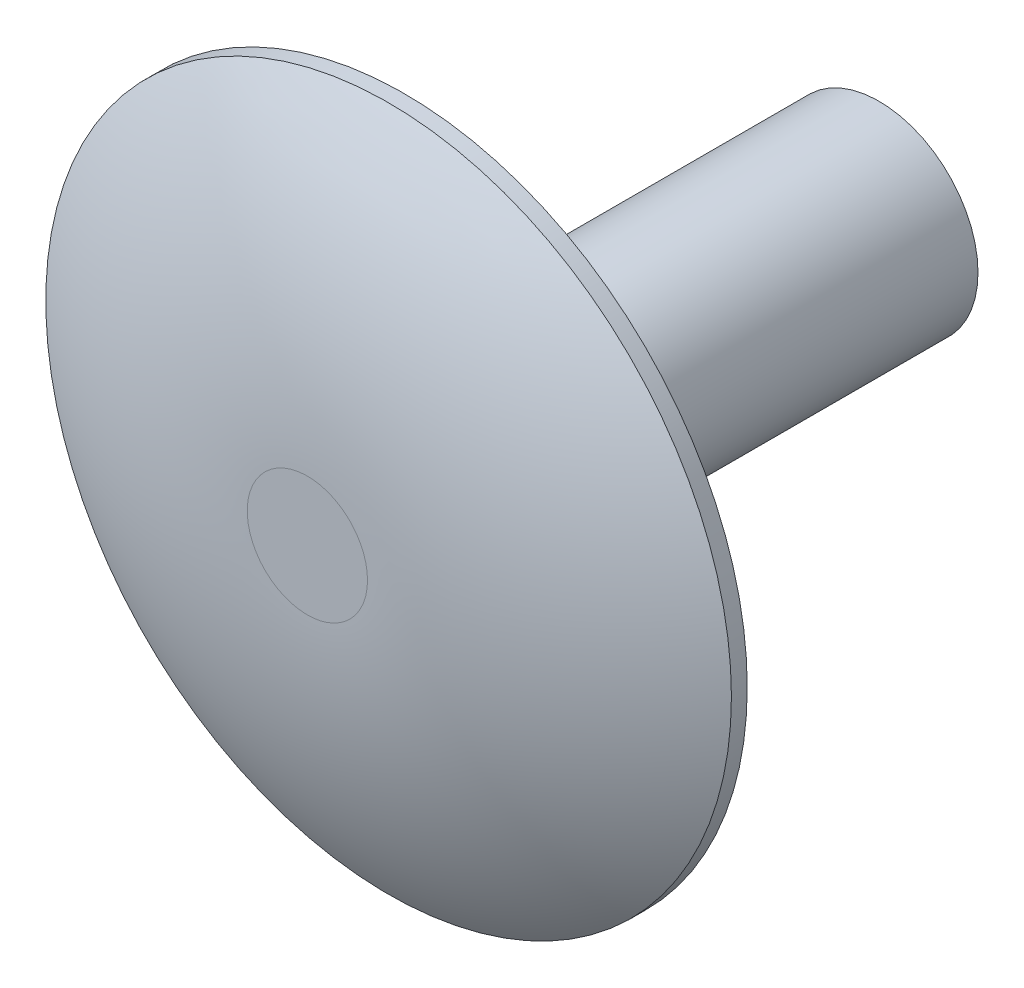
ISO-10303-21;
HEADER;
FILE_DESCRIPTION(('STEP AP214'),'2;1');
FILE_NAME('part.step','',(''),(''),'','','');
FILE_SCHEMA(('AUTOMOTIVE_DESIGN { 1 0 10303 214 1 1 1 1 }'));
ENDSEC;
DATA;
#1=APPLICATION_CONTEXT('core data for automotive mechanical design processes');
#2=APPLICATION_PROTOCOL_DEFINITION('international standard','automotive_design',2000,#1);
#3=PRODUCT_CONTEXT('',#1,'mechanical');
#4=PRODUCT('Part','Part','',(#3));
#5=PRODUCT_RELATED_PRODUCT_CATEGORY('part','',(#4));
#6=PRODUCT_DEFINITION_FORMATION('','',#4);
#7=PRODUCT_DEFINITION_CONTEXT('part definition',#1,'design');
#8=PRODUCT_DEFINITION('design','',#6,#7);
#9=PRODUCT_DEFINITION_SHAPE('','',#8);
#10=(LENGTH_UNIT() NAMED_UNIT(*) SI_UNIT(.MILLI.,.METRE.));
#11=(NAMED_UNIT(*) PLANE_ANGLE_UNIT() SI_UNIT($,.RADIAN.));
#12=(NAMED_UNIT(*) SI_UNIT($,.STERADIAN.) SOLID_ANGLE_UNIT());
#13=UNCERTAINTY_MEASURE_WITH_UNIT(LENGTH_MEASURE(1.E-05),#10,'distance_accuracy_value','');
#14=(GEOMETRIC_REPRESENTATION_CONTEXT(3) GLOBAL_UNCERTAINTY_ASSIGNED_CONTEXT((#13)) GLOBAL_UNIT_ASSIGNED_CONTEXT((#10,
#11,#12)) REPRESENTATION_CONTEXT('',''));
#15=CARTESIAN_POINT('',(0.,0.,0.));
#16=DIRECTION('',(0.,0.,1.));
#17=DIRECTION('',(1.,0.,0.));
#18=AXIS2_PLACEMENT_3D('',#15,#16,#17);
#19=CARTESIAN_POINT('',(0.,0.,2.3368));
#20=DIRECTION('',(0.,0.,-1.));
#21=DIRECTION('',(-1.,0.,0.));
#22=AXIS2_PLACEMENT_3D('',#19,#20,#21);
#23=CYLINDRICAL_SURFACE('',#22,8.255);
#24=CARTESIAN_POINT('',(0.,0.,0.));
#25=DIRECTION('',(0.,0.,1.));
#26=DIRECTION('',(1.,0.,0.));
#27=AXIS2_PLACEMENT_3D('',#24,#25,#26);
#28=CIRCLE('',#27,8.255);
#29=CARTESIAN_POINT('',(8.255,0.,0.));
#30=VERTEX_POINT('',#29);
#31=EDGE_CURVE('E10',#30,#30,#28,.T.);
#32=ORIENTED_EDGE('',*,*,#31,.T.);
#33=EDGE_LOOP('',(#32));
#34=FACE_BOUND('',#33,.T.);
#35=CARTESIAN_POINT('',(0.,0.,0.381));
#36=DIRECTION('',(0.,0.,1.));
#37=DIRECTION('',(1.,0.,0.));
#38=AXIS2_PLACEMENT_3D('',#35,#36,#37);
#39=CIRCLE('',#38,8.255);
#40=CARTESIAN_POINT('',(8.255,0.,0.381));
#41=VERTEX_POINT('',#40);
#42=EDGE_CURVE('E51',#41,#41,#39,.T.);
#43=ORIENTED_EDGE('',*,*,#42,.F.);
#44=EDGE_LOOP('',(#43));
#45=FACE_BOUND('',#44,.T.);
#46=ADVANCED_FACE('F32',(#34,#45),#23,.T.);
#47=CARTESIAN_POINT('',(0.,0.,0.));
#48=DIRECTION('',(0.,0.,1.));
#49=DIRECTION('',(1.,0.,0.));
#50=AXIS2_PLACEMENT_3D('',#47,#48,#49);
#51=PLANE('',#50);
#52=CARTESIAN_POINT('',(0.,0.,0.));
#53=DIRECTION('',(0.,0.,1.));
#54=DIRECTION('',(1.,0.,0.));
#55=AXIS2_PLACEMENT_3D('',#52,#53,#54);
#56=CIRCLE('',#55,2.38125);
#57=CARTESIAN_POINT('',(2.38125,0.,0.));
#58=VERTEX_POINT('',#57);
#59=EDGE_CURVE('E42',#58,#58,#56,.T.);
#60=ORIENTED_EDGE('',*,*,#59,.T.);
#61=EDGE_LOOP('',(#60));
#62=FACE_BOUND('',#61,.T.);
#63=ORIENTED_EDGE('',*,*,#31,.F.);
#64=EDGE_LOOP('',(#63));
#65=FACE_BOUND('',#64,.T.);
#66=ADVANCED_FACE('F59',(#62,#65),#51,.F.);
#67=CARTESIAN_POINT('',(0.,0.,-11.43));
#68=DIRECTION('',(0.,0.,1.));
#69=DIRECTION('',(1.,0.,0.));
#70=AXIS2_PLACEMENT_3D('',#67,#68,#69);
#71=CYLINDRICAL_SURFACE('',#70,2.38125);
#72=CARTESIAN_POINT('',(0.,0.,-11.43));
#73=DIRECTION('',(0.,0.,1.));
#74=DIRECTION('',(1.,0.,0.));
#75=AXIS2_PLACEMENT_3D('',#72,#73,#74);
#76=CIRCLE('',#75,2.38125);
#77=CARTESIAN_POINT('',(2.38125,0.,-11.43));
#78=VERTEX_POINT('',#77);
#79=EDGE_CURVE('E38',#78,#78,#76,.T.);
#80=ORIENTED_EDGE('',*,*,#79,.T.);
#81=EDGE_LOOP('',(#80));
#82=FACE_BOUND('',#81,.T.);
#83=ORIENTED_EDGE('',*,*,#59,.F.);
#84=EDGE_LOOP('',(#83));
#85=FACE_BOUND('',#84,.T.);
#86=ADVANCED_FACE('F63',(#82,#85),#71,.T.);
#87=CARTESIAN_POINT('',(0.,0.,-11.43));
#88=DIRECTION('',(0.,0.,1.));
#89=DIRECTION('',(1.,0.,0.));
#90=AXIS2_PLACEMENT_3D('',#87,#88,#89);
#91=PLANE('',#90);
#92=ORIENTED_EDGE('',*,*,#79,.F.);
#93=EDGE_LOOP('',(#92));
#94=FACE_BOUND('',#93,.T.);
#95=ADVANCED_FACE('F68',(#94),#91,.F.);
#96=CARTESIAN_POINT('',(0.,0.,-10.4873961038961));
#97=DIRECTION('',(0.,0.,1.));
#98=DIRECTION('',(1.,0.,0.));
#99=AXIS2_PLACEMENT_3D('',#96,#97,#98);
#100=DEGENERATE_TOROIDAL_SURFACE('',#99,1.4478,12.8241961038961,.T.);
#101=ORIENTED_EDGE('',*,*,#42,.T.);
#102=EDGE_LOOP('',(#101));
#103=FACE_BOUND('',#102,.T.);
#104=CARTESIAN_POINT('',(0.,0.,2.3368));
#105=DIRECTION('',(0.,0.,1.));
#106=DIRECTION('',(1.,0.,0.));
#107=AXIS2_PLACEMENT_3D('',#104,#105,#106);
#108=CIRCLE('',#107,1.4478);
#109=CARTESIAN_POINT('',(1.4478,0.,2.3368));
#110=VERTEX_POINT('',#109);
#111=EDGE_CURVE('E47',#110,#110,#108,.T.);
#112=ORIENTED_EDGE('',*,*,#111,.F.);
#113=EDGE_LOOP('',(#112));
#114=FACE_BOUND('',#113,.T.);
#115=ADVANCED_FACE('F55',(#103,#114),#100,.T.);
#116=CARTESIAN_POINT('',(0.,0.,2.3368));
#117=DIRECTION('',(0.,0.,1.));
#118=DIRECTION('',(1.,0.,0.));
#119=AXIS2_PLACEMENT_3D('',#116,#117,#118);
#120=PLANE('',#119);
#121=ORIENTED_EDGE('',*,*,#111,.T.);
#122=EDGE_LOOP('',(#121));
#123=FACE_BOUND('',#122,.T.);
#124=ADVANCED_FACE('F72',(#123),#120,.T.);
#125=CLOSED_SHELL('',(#46,#66,#86,#95,#115,#124));
#126=MANIFOLD_SOLID_BREP('B2',#125);
#127=ADVANCED_BREP_SHAPE_REPRESENTATION('',(#18,#126),#14);
#128=SHAPE_DEFINITION_REPRESENTATION(#9,#127);
ENDSEC;
END-ISO-10303-21;
